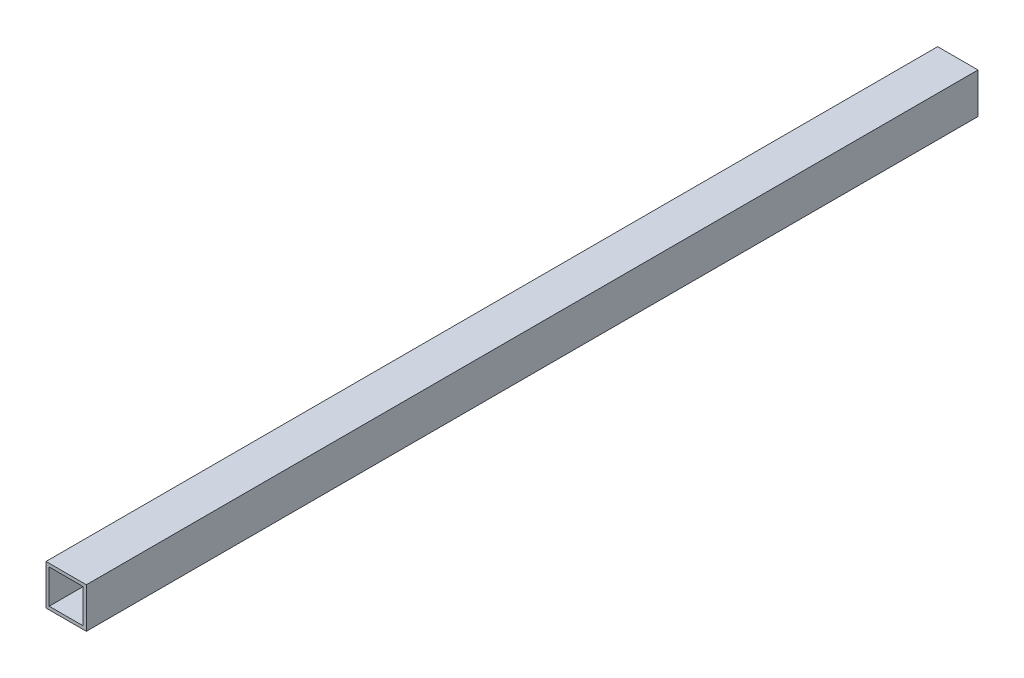
ISO-10303-21;
HEADER;
FILE_DESCRIPTION(('STEP AP214'),'2;1');
FILE_NAME('part.step','',(''),(''),'','','');
FILE_SCHEMA(('AUTOMOTIVE_DESIGN { 1 0 10303 214 1 1 1 1 }'));
ENDSEC;
DATA;
#1=APPLICATION_CONTEXT('core data for automotive mechanical design processes');
#2=APPLICATION_PROTOCOL_DEFINITION('international standard','automotive_design',2000,#1);
#3=PRODUCT_CONTEXT('',#1,'mechanical');
#4=PRODUCT('Part','Part','',(#3));
#5=PRODUCT_RELATED_PRODUCT_CATEGORY('part','',(#4));
#6=PRODUCT_DEFINITION_FORMATION('','',#4);
#7=PRODUCT_DEFINITION_CONTEXT('part definition',#1,'design');
#8=PRODUCT_DEFINITION('design','',#6,#7);
#9=PRODUCT_DEFINITION_SHAPE('','',#8);
#10=(LENGTH_UNIT() NAMED_UNIT(*) SI_UNIT(.MILLI.,.METRE.));
#11=(NAMED_UNIT(*) PLANE_ANGLE_UNIT() SI_UNIT($,.RADIAN.));
#12=(NAMED_UNIT(*) SI_UNIT($,.STERADIAN.) SOLID_ANGLE_UNIT());
#13=UNCERTAINTY_MEASURE_WITH_UNIT(LENGTH_MEASURE(1.E-05),#10,'distance_accuracy_value','');
#14=(GEOMETRIC_REPRESENTATION_CONTEXT(3) GLOBAL_UNCERTAINTY_ASSIGNED_CONTEXT((#13)) GLOBAL_UNIT_ASSIGNED_CONTEXT((#10,
#11,#12)) REPRESENTATION_CONTEXT('',''));
#15=CARTESIAN_POINT('',(0.,0.,0.));
#16=DIRECTION('',(0.,0.,1.));
#17=DIRECTION('',(1.,0.,0.));
#18=AXIS2_PLACEMENT_3D('',#15,#16,#17);
#19=CARTESIAN_POINT('',(0.,0.,561.2));
#20=DIRECTION('',(0.,0.,-1.));
#21=DIRECTION('',(-1.,0.,0.));
#22=AXIS2_PLACEMENT_3D('',#19,#20,#21);
#23=PLANE('',#22);
#24=DIRECTION('',(0.,-1.,0.));
#25=VECTOR('',#24,1.);
#26=CARTESIAN_POINT('',(-12.7,12.7,561.2));
#27=LINE('',#26,#25);
#28=CARTESIAN_POINT('',(-12.7,12.7,561.2));
#29=VERTEX_POINT('',#28);
#30=CARTESIAN_POINT('',(-12.7,-12.7,561.2));
#31=VERTEX_POINT('',#30);
#32=EDGE_CURVE('E157',#29,#31,#27,.T.);
#33=ORIENTED_EDGE('',*,*,#32,.T.);
#34=DIRECTION('',(1.,0.,0.));
#35=VECTOR('',#34,1.);
#36=CARTESIAN_POINT('',(12.7,-12.7,561.2));
#37=LINE('',#36,#35);
#38=CARTESIAN_POINT('',(12.7,-12.7,561.2));
#39=VERTEX_POINT('',#38);
#40=EDGE_CURVE('E161',#31,#39,#37,.T.);
#41=ORIENTED_EDGE('',*,*,#40,.T.);
#42=DIRECTION('',(0.,1.,0.));
#43=VECTOR('',#42,1.);
#44=CARTESIAN_POINT('',(12.7,12.7,561.2));
#45=LINE('',#44,#43);
#46=CARTESIAN_POINT('',(12.7,12.7,561.2));
#47=VERTEX_POINT('',#46);
#48=EDGE_CURVE('E165',#39,#47,#45,.T.);
#49=ORIENTED_EDGE('',*,*,#48,.T.);
#50=DIRECTION('',(-1.,0.,0.));
#51=VECTOR('',#50,1.);
#52=CARTESIAN_POINT('',(12.7,12.7,561.2));
#53=LINE('',#52,#51);
#54=EDGE_CURVE('E168',#47,#29,#53,.T.);
#55=ORIENTED_EDGE('',*,*,#54,.T.);
#56=EDGE_LOOP('',(#33,#41,#49,#55));
#57=FACE_BOUND('',#56,.T.);
#58=DIRECTION('',(0.,1.,0.));
#59=VECTOR('',#58,1.);
#60=CARTESIAN_POINT('',(10.7,10.7,561.2));
#61=LINE('',#60,#59);
#62=CARTESIAN_POINT('',(10.7,-10.7,561.2));
#63=VERTEX_POINT('',#62);
#64=CARTESIAN_POINT('',(10.7,10.7,561.2));
#65=VERTEX_POINT('',#64);
#66=EDGE_CURVE('E109',#63,#65,#61,.T.);
#67=ORIENTED_EDGE('',*,*,#66,.F.);
#68=DIRECTION('',(1.,0.,0.));
#69=VECTOR('',#68,1.);
#70=CARTESIAN_POINT('',(10.7,-10.7,561.2));
#71=LINE('',#70,#69);
#72=CARTESIAN_POINT('',(-10.7,-10.7,561.2));
#73=VERTEX_POINT('',#72);
#74=EDGE_CURVE('E135',#73,#63,#71,.T.);
#75=ORIENTED_EDGE('',*,*,#74,.F.);
#76=DIRECTION('',(0.,-1.,0.));
#77=VECTOR('',#76,1.);
#78=CARTESIAN_POINT('',(-10.7,10.7,561.2));
#79=LINE('',#78,#77);
#80=CARTESIAN_POINT('',(-10.7,10.7,561.2));
#81=VERTEX_POINT('',#80);
#82=EDGE_CURVE('E131',#81,#73,#79,.T.);
#83=ORIENTED_EDGE('',*,*,#82,.F.);
#84=DIRECTION('',(-1.,0.,0.));
#85=VECTOR('',#84,1.);
#86=CARTESIAN_POINT('',(10.7,10.7,561.2));
#87=LINE('',#86,#85);
#88=EDGE_CURVE('E118',#65,#81,#87,.T.);
#89=ORIENTED_EDGE('',*,*,#88,.F.);
#90=EDGE_LOOP('',(#67,#75,#83,#89));
#91=FACE_BOUND('',#90,.T.);
#92=ADVANCED_FACE('F43',(#57,#91),#23,.F.);
#93=CARTESIAN_POINT('',(0.,0.,0.));
#94=DIRECTION('',(0.,0.,-1.));
#95=DIRECTION('',(-1.,0.,0.));
#96=AXIS2_PLACEMENT_3D('',#93,#94,#95);
#97=PLANE('',#96);
#98=DIRECTION('',(0.,-1.,0.));
#99=VECTOR('',#98,1.);
#100=CARTESIAN_POINT('',(-12.7,12.7,0.));
#101=LINE('',#100,#99);
#102=CARTESIAN_POINT('',(-12.7,12.7,0.));
#103=VERTEX_POINT('',#102);
#104=CARTESIAN_POINT('',(-12.7,-12.7,0.));
#105=VERTEX_POINT('',#104);
#106=EDGE_CURVE('E127',#103,#105,#101,.T.);
#107=ORIENTED_EDGE('',*,*,#106,.F.);
#108=DIRECTION('',(-1.,0.,0.));
#109=VECTOR('',#108,1.);
#110=CARTESIAN_POINT('',(12.7,12.7,0.));
#111=LINE('',#110,#109);
#112=CARTESIAN_POINT('',(12.7,12.7,0.));
#113=VERTEX_POINT('',#112);
#114=EDGE_CURVE('E162',#113,#103,#111,.T.);
#115=ORIENTED_EDGE('',*,*,#114,.F.);
#116=DIRECTION('',(0.,1.,0.));
#117=VECTOR('',#116,1.);
#118=CARTESIAN_POINT('',(12.7,12.7,0.));
#119=LINE('',#118,#117);
#120=CARTESIAN_POINT('',(12.7,-12.7,0.));
#121=VERTEX_POINT('',#120);
#122=EDGE_CURVE('E178',#121,#113,#119,.T.);
#123=ORIENTED_EDGE('',*,*,#122,.F.);
#124=DIRECTION('',(1.,0.,0.));
#125=VECTOR('',#124,1.);
#126=CARTESIAN_POINT('',(12.7,-12.7,0.));
#127=LINE('',#126,#125);
#128=EDGE_CURVE('E175',#105,#121,#127,.T.);
#129=ORIENTED_EDGE('',*,*,#128,.F.);
#130=EDGE_LOOP('',(#107,#115,#123,#129));
#131=FACE_BOUND('',#130,.T.);
#132=DIRECTION('',(1.,0.,0.));
#133=VECTOR('',#132,1.);
#134=CARTESIAN_POINT('',(10.7,-10.7,0.));
#135=LINE('',#134,#133);
#136=CARTESIAN_POINT('',(-10.7,-10.7,0.));
#137=VERTEX_POINT('',#136);
#138=CARTESIAN_POINT('',(10.7,-10.7,0.));
#139=VERTEX_POINT('',#138);
#140=EDGE_CURVE('E119',#137,#139,#135,.T.);
#141=ORIENTED_EDGE('',*,*,#140,.T.);
#142=DIRECTION('',(0.,1.,0.));
#143=VECTOR('',#142,1.);
#144=CARTESIAN_POINT('',(10.7,10.7,0.));
#145=LINE('',#144,#143);
#146=CARTESIAN_POINT('',(10.7,10.7,0.));
#147=VERTEX_POINT('',#146);
#148=EDGE_CURVE('E67',#139,#147,#145,.T.);
#149=ORIENTED_EDGE('',*,*,#148,.T.);
#150=DIRECTION('',(-1.,0.,0.));
#151=VECTOR('',#150,1.);
#152=CARTESIAN_POINT('',(10.7,10.7,0.));
#153=LINE('',#152,#151);
#154=CARTESIAN_POINT('',(-10.7,10.7,0.));
#155=VERTEX_POINT('',#154);
#156=EDGE_CURVE('E125',#147,#155,#153,.T.);
#157=ORIENTED_EDGE('',*,*,#156,.T.);
#158=DIRECTION('',(0.,-1.,0.));
#159=VECTOR('',#158,1.);
#160=CARTESIAN_POINT('',(-10.7,10.7,0.));
#161=LINE('',#160,#159);
#162=EDGE_CURVE('E144',#155,#137,#161,.T.);
#163=ORIENTED_EDGE('',*,*,#162,.T.);
#164=EDGE_LOOP('',(#141,#149,#157,#163));
#165=FACE_BOUND('',#164,.T.);
#166=ADVANCED_FACE('F201',(#131,#165),#97,.T.);
#167=CARTESIAN_POINT('',(-12.7,12.7,561.2));
#168=DIRECTION('',(1.,0.,0.));
#169=DIRECTION('',(0.,1.,0.));
#170=AXIS2_PLACEMENT_3D('',#167,#168,#169);
#171=PLANE('',#170);
#172=ORIENTED_EDGE('',*,*,#106,.T.);
#173=DIRECTION('',(0.,0.,-1.));
#174=VECTOR('',#173,1.);
#175=CARTESIAN_POINT('',(-12.7,-12.7,561.2));
#176=LINE('',#175,#174);
#177=EDGE_CURVE('E11',#31,#105,#176,.T.);
#178=ORIENTED_EDGE('',*,*,#177,.F.);
#179=ORIENTED_EDGE('',*,*,#32,.F.);
#180=DIRECTION('',(0.,0.,-1.));
#181=VECTOR('',#180,1.);
#182=CARTESIAN_POINT('',(-12.7,12.7,561.2));
#183=LINE('',#182,#181);
#184=EDGE_CURVE('E171',#29,#103,#183,.T.);
#185=ORIENTED_EDGE('',*,*,#184,.T.);
#186=EDGE_LOOP('',(#172,#178,#179,#185));
#187=FACE_BOUND('',#186,.T.);
#188=ADVANCED_FACE('F45',(#187),#171,.F.);
#189=CARTESIAN_POINT('',(12.7,-12.7,561.2));
#190=DIRECTION('',(0.,1.,0.));
#191=DIRECTION('',(-1.,0.,0.));
#192=AXIS2_PLACEMENT_3D('',#189,#190,#191);
#193=PLANE('',#192);
#194=ORIENTED_EDGE('',*,*,#128,.T.);
#195=DIRECTION('',(0.,0.,-1.));
#196=VECTOR('',#195,1.);
#197=CARTESIAN_POINT('',(12.7,-12.7,561.2));
#198=LINE('',#197,#196);
#199=EDGE_CURVE('E52',#39,#121,#198,.T.);
#200=ORIENTED_EDGE('',*,*,#199,.F.);
#201=ORIENTED_EDGE('',*,*,#40,.F.);
#202=ORIENTED_EDGE('',*,*,#177,.T.);
#203=EDGE_LOOP('',(#194,#200,#201,#202));
#204=FACE_BOUND('',#203,.T.);
#205=ADVANCED_FACE('F211',(#204),#193,.F.);
#206=CARTESIAN_POINT('',(12.7,12.7,561.2));
#207=DIRECTION('',(-1.,0.,0.));
#208=DIRECTION('',(0.,-1.,0.));
#209=AXIS2_PLACEMENT_3D('',#206,#207,#208);
#210=PLANE('',#209);
#211=ORIENTED_EDGE('',*,*,#122,.T.);
#212=DIRECTION('',(0.,0.,-1.));
#213=VECTOR('',#212,1.);
#214=CARTESIAN_POINT('',(12.7,12.7,561.2));
#215=LINE('',#214,#213);
#216=EDGE_CURVE('E186',#47,#113,#215,.T.);
#217=ORIENTED_EDGE('',*,*,#216,.F.);
#218=ORIENTED_EDGE('',*,*,#48,.F.);
#219=ORIENTED_EDGE('',*,*,#199,.T.);
#220=EDGE_LOOP('',(#211,#217,#218,#219));
#221=FACE_BOUND('',#220,.T.);
#222=ADVANCED_FACE('F195',(#221),#210,.F.);
#223=CARTESIAN_POINT('',(12.7,12.7,561.2));
#224=DIRECTION('',(0.,-1.,0.));
#225=DIRECTION('',(1.,0.,0.));
#226=AXIS2_PLACEMENT_3D('',#223,#224,#225);
#227=PLANE('',#226);
#228=ORIENTED_EDGE('',*,*,#114,.T.);
#229=ORIENTED_EDGE('',*,*,#184,.F.);
#230=ORIENTED_EDGE('',*,*,#54,.F.);
#231=ORIENTED_EDGE('',*,*,#216,.T.);
#232=EDGE_LOOP('',(#228,#229,#230,#231));
#233=FACE_BOUND('',#232,.T.);
#234=ADVANCED_FACE('F205',(#233),#227,.F.);
#235=CARTESIAN_POINT('',(10.7,10.7,561.2));
#236=DIRECTION('',(-1.,0.,0.));
#237=DIRECTION('',(0.,-1.,0.));
#238=AXIS2_PLACEMENT_3D('',#235,#236,#237);
#239=PLANE('',#238);
#240=ORIENTED_EDGE('',*,*,#148,.F.);
#241=DIRECTION('',(0.,0.,-1.));
#242=VECTOR('',#241,1.);
#243=CARTESIAN_POINT('',(10.7,-10.7,561.2));
#244=LINE('',#243,#242);
#245=EDGE_CURVE('E113',#63,#139,#244,.T.);
#246=ORIENTED_EDGE('',*,*,#245,.F.);
#247=ORIENTED_EDGE('',*,*,#66,.T.);
#248=DIRECTION('',(0.,0.,-1.));
#249=VECTOR('',#248,1.);
#250=CARTESIAN_POINT('',(10.7,10.7,561.2));
#251=LINE('',#250,#249);
#252=EDGE_CURVE('E112',#65,#147,#251,.T.);
#253=ORIENTED_EDGE('',*,*,#252,.T.);
#254=EDGE_LOOP('',(#240,#246,#247,#253));
#255=FACE_BOUND('',#254,.T.);
#256=ADVANCED_FACE('F111',(#255),#239,.T.);
#257=CARTESIAN_POINT('',(10.7,10.7,561.2));
#258=DIRECTION('',(0.,-1.,0.));
#259=DIRECTION('',(1.,0.,0.));
#260=AXIS2_PLACEMENT_3D('',#257,#258,#259);
#261=PLANE('',#260);
#262=ORIENTED_EDGE('',*,*,#156,.F.);
#263=ORIENTED_EDGE('',*,*,#252,.F.);
#264=ORIENTED_EDGE('',*,*,#88,.T.);
#265=DIRECTION('',(0.,0.,-1.));
#266=VECTOR('',#265,1.);
#267=CARTESIAN_POINT('',(-10.7,10.7,561.2));
#268=LINE('',#267,#266);
#269=EDGE_CURVE('E128',#81,#155,#268,.T.);
#270=ORIENTED_EDGE('',*,*,#269,.T.);
#271=EDGE_LOOP('',(#262,#263,#264,#270));
#272=FACE_BOUND('',#271,.T.);
#273=ADVANCED_FACE('F122',(#272),#261,.T.);
#274=CARTESIAN_POINT('',(-10.7,10.7,561.2));
#275=DIRECTION('',(1.,0.,0.));
#276=DIRECTION('',(0.,1.,0.));
#277=AXIS2_PLACEMENT_3D('',#274,#275,#276);
#278=PLANE('',#277);
#279=ORIENTED_EDGE('',*,*,#162,.F.);
#280=ORIENTED_EDGE('',*,*,#269,.F.);
#281=ORIENTED_EDGE('',*,*,#82,.T.);
#282=DIRECTION('',(0.,0.,-1.));
#283=VECTOR('',#282,1.);
#284=CARTESIAN_POINT('',(-10.7,-10.7,561.2));
#285=LINE('',#284,#283);
#286=EDGE_CURVE('E59',#73,#137,#285,.T.);
#287=ORIENTED_EDGE('',*,*,#286,.T.);
#288=EDGE_LOOP('',(#279,#280,#281,#287));
#289=FACE_BOUND('',#288,.T.);
#290=ADVANCED_FACE('F234',(#289),#278,.T.);
#291=CARTESIAN_POINT('',(10.7,-10.7,561.2));
#292=DIRECTION('',(0.,1.,0.));
#293=DIRECTION('',(-1.,0.,0.));
#294=AXIS2_PLACEMENT_3D('',#291,#292,#293);
#295=PLANE('',#294);
#296=ORIENTED_EDGE('',*,*,#140,.F.);
#297=ORIENTED_EDGE('',*,*,#286,.F.);
#298=ORIENTED_EDGE('',*,*,#74,.T.);
#299=ORIENTED_EDGE('',*,*,#245,.T.);
#300=EDGE_LOOP('',(#296,#297,#298,#299));
#301=FACE_BOUND('',#300,.T.);
#302=ADVANCED_FACE('F238',(#301),#295,.T.);
#303=CLOSED_SHELL('',(#92,#166,#188,#205,#222,#234,#256,#273,#290,#302));
#304=MANIFOLD_SOLID_BREP('B2',#303);
#305=ADVANCED_BREP_SHAPE_REPRESENTATION('',(#18,#304),#14);
#306=SHAPE_DEFINITION_REPRESENTATION(#9,#305);
ENDSEC;
END-ISO-10303-21;
